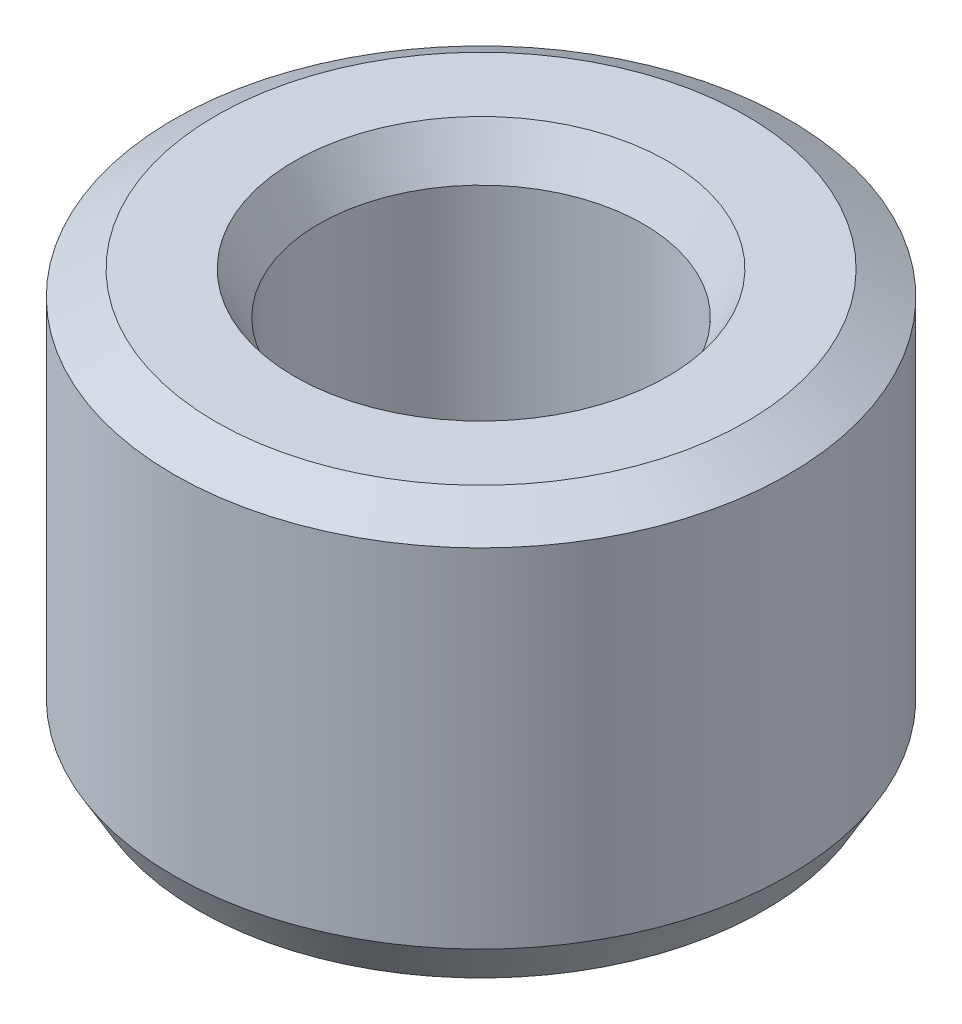
ISO-10303-21;
HEADER;
FILE_DESCRIPTION(('STEP AP214'),'2;1');
FILE_NAME('part.step','',(''),(''),'','','');
FILE_SCHEMA(('AUTOMOTIVE_DESIGN { 1 0 10303 214 1 1 1 1 }'));
ENDSEC;
DATA;
#1=APPLICATION_CONTEXT('core data for automotive mechanical design processes');
#2=APPLICATION_PROTOCOL_DEFINITION('international standard','automotive_design',2000,#1);
#3=PRODUCT_CONTEXT('',#1,'mechanical');
#4=PRODUCT('Part','Part','',(#3));
#5=PRODUCT_RELATED_PRODUCT_CATEGORY('part','',(#4));
#6=PRODUCT_DEFINITION_FORMATION('','',#4);
#7=PRODUCT_DEFINITION_CONTEXT('part definition',#1,'design');
#8=PRODUCT_DEFINITION('design','',#6,#7);
#9=PRODUCT_DEFINITION_SHAPE('','',#8);
#10=(LENGTH_UNIT() NAMED_UNIT(*) SI_UNIT(.MILLI.,.METRE.));
#11=(NAMED_UNIT(*) PLANE_ANGLE_UNIT() SI_UNIT($,.RADIAN.));
#12=(NAMED_UNIT(*) SI_UNIT($,.STERADIAN.) SOLID_ANGLE_UNIT());
#13=UNCERTAINTY_MEASURE_WITH_UNIT(LENGTH_MEASURE(1.E-05),#10,'distance_accuracy_value','');
#14=(GEOMETRIC_REPRESENTATION_CONTEXT(3) GLOBAL_UNCERTAINTY_ASSIGNED_CONTEXT((#13)) GLOBAL_UNIT_ASSIGNED_CONTEXT((#10,
#11,#12)) REPRESENTATION_CONTEXT('',''));
#15=CARTESIAN_POINT('',(0.,0.,0.));
#16=DIRECTION('',(0.,0.,1.));
#17=DIRECTION('',(1.,0.,0.));
#18=AXIS2_PLACEMENT_3D('',#15,#16,#17);
#19=CARTESIAN_POINT('',(0.,6.73457206104366,0.));
#20=DIRECTION('',(0.,-1.,0.));
#21=DIRECTION('',(0.,0.,-1.));
#22=AXIS2_PLACEMENT_3D('',#19,#20,#21);
#23=CYLINDRICAL_SURFACE('',#22,5.);
#24=CARTESIAN_POINT('',(0.,0.68696754505938,0.));
#25=DIRECTION('',(0.,1.,0.));
#26=DIRECTION('',(0.,0.,1.));
#27=AXIS2_PLACEMENT_3D('',#24,#25,#26);
#28=CIRCLE('',#27,5.);
#29=CARTESIAN_POINT('',(0.,0.68696754505938,5.));
#30=VERTEX_POINT('',#29);
#31=EDGE_CURVE('E10',#30,#30,#28,.T.);
#32=ORIENTED_EDGE('',*,*,#31,.T.);
#33=EDGE_LOOP('',(#32));
#34=FACE_BOUND('',#33,.T.);
#35=CARTESIAN_POINT('',(0.,6.33795116397909,0.));
#36=DIRECTION('',(0.,1.,0.));
#37=DIRECTION('',(0.,0.,1.));
#38=AXIS2_PLACEMENT_3D('',#35,#36,#37);
#39=CIRCLE('',#38,5.);
#40=CARTESIAN_POINT('',(0.,6.33795116397909,5.));
#41=VERTEX_POINT('',#40);
#42=EDGE_CURVE('E50',#41,#41,#39,.F.);
#43=ORIENTED_EDGE('',*,*,#42,.T.);
#44=EDGE_LOOP('',(#43));
#45=FACE_BOUND('',#44,.T.);
#46=ADVANCED_FACE('F39',(#34,#45),#23,.T.);
#47=CARTESIAN_POINT('',(0.,6.73457206104366,0.));
#48=DIRECTION('',(0.,1.,0.));
#49=DIRECTION('',(0.,0.,1.));
#50=AXIS2_PLACEMENT_3D('',#47,#48,#49);
#51=PLANE('',#50);
#52=CARTESIAN_POINT('',(0.,6.73457206104366,0.));
#53=DIRECTION('',(0.,1.,0.));
#54=DIRECTION('',(0.,0.,1.));
#55=AXIS2_PLACEMENT_3D('',#52,#53,#54);
#56=CIRCLE('',#55,3.03432746312174);
#57=CARTESIAN_POINT('',(0.,6.73457206104366,3.03432746312174));
#58=VERTEX_POINT('',#57);
#59=EDGE_CURVE('E58',#58,#58,#56,.F.);
#60=ORIENTED_EDGE('',*,*,#59,.T.);
#61=EDGE_LOOP('',(#60));
#62=FACE_BOUND('',#61,.T.);
#63=CARTESIAN_POINT('',(0.,6.73457206104366,0.));
#64=DIRECTION('',(0.,1.,0.));
#65=DIRECTION('',(0.,0.,1.));
#66=AXIS2_PLACEMENT_3D('',#63,#64,#65);
#67=CIRCLE('',#66,4.31303245494063);
#68=CARTESIAN_POINT('',(0.,6.73457206104366,4.31303245494063));
#69=VERTEX_POINT('',#68);
#70=EDGE_CURVE('E61',#69,#69,#67,.T.);
#71=ORIENTED_EDGE('',*,*,#70,.T.);
#72=EDGE_LOOP('',(#71));
#73=FACE_BOUND('',#72,.T.);
#74=ADVANCED_FACE('F88',(#62,#73),#51,.T.);
#75=CARTESIAN_POINT('',(0.,0.,0.));
#76=DIRECTION('',(0.,1.,0.));
#77=DIRECTION('',(0.,0.,1.));
#78=AXIS2_PLACEMENT_3D('',#75,#76,#77);
#79=PLANE('',#78);
#80=CARTESIAN_POINT('',(0.,0.,0.));
#81=DIRECTION('',(0.,1.,0.));
#82=DIRECTION('',(0.,0.,1.));
#83=AXIS2_PLACEMENT_3D('',#80,#81,#82);
#84=CIRCLE('',#83,3.32467411111654);
#85=CARTESIAN_POINT('',(0.,0.,3.32467411111654));
#86=VERTEX_POINT('',#85);
#87=EDGE_CURVE('E51',#86,#86,#84,.T.);
#88=ORIENTED_EDGE('',*,*,#87,.T.);
#89=EDGE_LOOP('',(#88));
#90=FACE_BOUND('',#89,.T.);
#91=CARTESIAN_POINT('',(0.,0.,0.));
#92=DIRECTION('',(0.,1.,0.));
#93=DIRECTION('',(0.,0.,1.));
#94=AXIS2_PLACEMENT_3D('',#91,#92,#93);
#95=CIRCLE('',#94,4.60337910293543);
#96=CARTESIAN_POINT('',(0.,0.,4.60337910293543));
#97=VERTEX_POINT('',#96);
#98=EDGE_CURVE('E54',#97,#97,#95,.F.);
#99=ORIENTED_EDGE('',*,*,#98,.T.);
#100=EDGE_LOOP('',(#99));
#101=FACE_BOUND('',#100,.T.);
#102=ADVANCED_FACE('F83',(#90,#101),#79,.F.);
#103=CARTESIAN_POINT('',(0.,6.73457206104366,0.));
#104=DIRECTION('',(0.,-1.,0.));
#105=DIRECTION('',(0.,0.,-1.));
#106=AXIS2_PLACEMENT_3D('',#103,#104,#105);
#107=CYLINDRICAL_SURFACE('',#106,2.63770656605717);
#108=CARTESIAN_POINT('',(0.,6.04760451598429,0.));
#109=DIRECTION('',(0.,1.,0.));
#110=DIRECTION('',(0.,0.,1.));
#111=AXIS2_PLACEMENT_3D('',#108,#109,#110);
#112=CIRCLE('',#111,2.63770656605717);
#113=CARTESIAN_POINT('',(0.,6.04760451598429,2.63770656605717));
#114=VERTEX_POINT('',#113);
#115=EDGE_CURVE('E67',#114,#114,#112,.T.);
#116=ORIENTED_EDGE('',*,*,#115,.T.);
#117=EDGE_LOOP('',(#116));
#118=FACE_BOUND('',#117,.T.);
#119=CARTESIAN_POINT('',(0.,0.396620897064568,0.));
#120=DIRECTION('',(0.,1.,0.));
#121=DIRECTION('',(0.,0.,1.));
#122=AXIS2_PLACEMENT_3D('',#119,#120,#121);
#123=CIRCLE('',#122,2.63770656605717);
#124=CARTESIAN_POINT('',(0.,0.396620897064568,2.63770656605717));
#125=VERTEX_POINT('',#124);
#126=EDGE_CURVE('E69',#125,#125,#123,.F.);
#127=ORIENTED_EDGE('',*,*,#126,.T.);
#128=EDGE_LOOP('',(#127));
#129=FACE_BOUND('',#128,.T.);
#130=ADVANCED_FACE('F71',(#118,#129),#107,.F.);
#131=CARTESIAN_POINT('',(0.,6.04760451598429,0.));
#132=DIRECTION('',(0.,1.,0.));
#133=DIRECTION('',(0.,0.,1.));
#134=AXIS2_PLACEMENT_3D('',#131,#132,#133);
#135=CONICAL_SURFACE('',#134,2.63770656605717,0.523598775598304);
#136=ORIENTED_EDGE('',*,*,#59,.F.);
#137=EDGE_LOOP('',(#136));
#138=FACE_BOUND('',#137,.T.);
#139=ORIENTED_EDGE('',*,*,#115,.F.);
#140=EDGE_LOOP('',(#139));
#141=FACE_BOUND('',#140,.T.);
#142=ADVANCED_FACE('F77',(#138,#141),#135,.F.);
#143=CARTESIAN_POINT('',(0.,0.,0.));
#144=DIRECTION('',(0.,-1.,0.));
#145=DIRECTION('',(0.,0.,-1.));
#146=AXIS2_PLACEMENT_3D('',#143,#144,#145);
#147=CONICAL_SURFACE('',#146,3.32467411111654,1.0471975511966);
#148=ORIENTED_EDGE('',*,*,#126,.F.);
#149=EDGE_LOOP('',(#148));
#150=FACE_BOUND('',#149,.T.);
#151=ORIENTED_EDGE('',*,*,#87,.F.);
#152=EDGE_LOOP('',(#151));
#153=FACE_BOUND('',#152,.T.);
#154=ADVANCED_FACE('F73',(#150,#153),#147,.F.);
#155=CARTESIAN_POINT('',(0.,0.68696754505938,0.));
#156=DIRECTION('',(0.,1.,0.));
#157=DIRECTION('',(0.,0.,1.));
#158=AXIS2_PLACEMENT_3D('',#155,#156,#157);
#159=CONICAL_SURFACE('',#158,5.,0.523598775598301);
#160=ORIENTED_EDGE('',*,*,#98,.F.);
#161=EDGE_LOOP('',(#160));
#162=FACE_BOUND('',#161,.T.);
#163=ORIENTED_EDGE('',*,*,#31,.F.);
#164=EDGE_LOOP('',(#163));
#165=FACE_BOUND('',#164,.T.);
#166=ADVANCED_FACE('F76',(#162,#165),#159,.T.);
#167=CARTESIAN_POINT('',(0.,6.73457206104366,0.));
#168=DIRECTION('',(0.,-1.,0.));
#169=DIRECTION('',(0.,0.,-1.));
#170=AXIS2_PLACEMENT_3D('',#167,#168,#169);
#171=CONICAL_SURFACE('',#170,4.31303245494063,1.04719755119659);
#172=ORIENTED_EDGE('',*,*,#42,.F.);
#173=EDGE_LOOP('',(#172));
#174=FACE_BOUND('',#173,.T.);
#175=ORIENTED_EDGE('',*,*,#70,.F.);
#176=EDGE_LOOP('',(#175));
#177=FACE_BOUND('',#176,.T.);
#178=ADVANCED_FACE('F45',(#174,#177),#171,.T.);
#179=CLOSED_SHELL('',(#46,#74,#102,#130,#142,#154,#166,#178));
#180=MANIFOLD_SOLID_BREP('B2',#179);
#181=ADVANCED_BREP_SHAPE_REPRESENTATION('',(#18,#180),#14);
#182=SHAPE_DEFINITION_REPRESENTATION(#9,#181);
ENDSEC;
END-ISO-10303-21;
